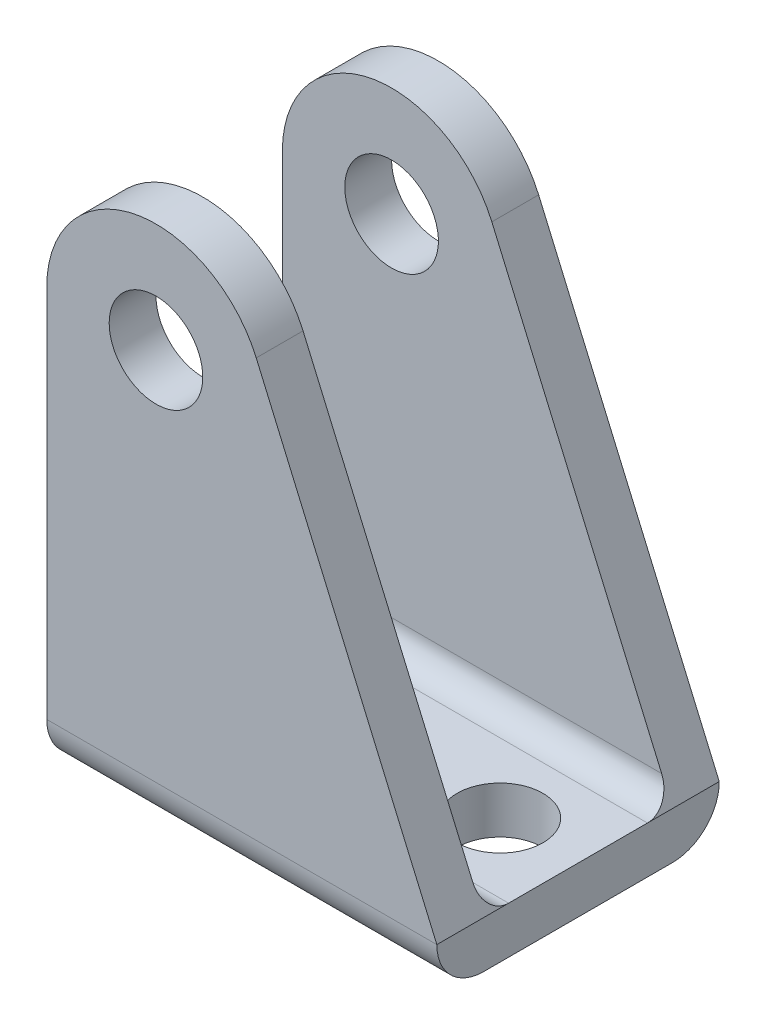
ISO-10303-21;
HEADER;
FILE_DESCRIPTION(('STEP AP214'),'2;1');
FILE_NAME('part.step','',(''),(''),'','','');
FILE_SCHEMA(('AUTOMOTIVE_DESIGN { 1 0 10303 214 1 1 1 1 }'));
ENDSEC;
DATA;
#1=APPLICATION_CONTEXT('core data for automotive mechanical design processes');
#2=APPLICATION_PROTOCOL_DEFINITION('international standard','automotive_design',2000,#1);
#3=PRODUCT_CONTEXT('',#1,'mechanical');
#4=PRODUCT('Part','Part','',(#3));
#5=PRODUCT_RELATED_PRODUCT_CATEGORY('part','',(#4));
#6=PRODUCT_DEFINITION_FORMATION('','',#4);
#7=PRODUCT_DEFINITION_CONTEXT('part definition',#1,'design');
#8=PRODUCT_DEFINITION('design','',#6,#7);
#9=PRODUCT_DEFINITION_SHAPE('','',#8);
#10=(LENGTH_UNIT() NAMED_UNIT(*) SI_UNIT(.MILLI.,.METRE.));
#11=(NAMED_UNIT(*) PLANE_ANGLE_UNIT() SI_UNIT($,.RADIAN.));
#12=(NAMED_UNIT(*) SI_UNIT($,.STERADIAN.) SOLID_ANGLE_UNIT());
#13=UNCERTAINTY_MEASURE_WITH_UNIT(LENGTH_MEASURE(1.E-05),#10,'distance_accuracy_value','');
#14=(GEOMETRIC_REPRESENTATION_CONTEXT(3) GLOBAL_UNCERTAINTY_ASSIGNED_CONTEXT((#13)) GLOBAL_UNIT_ASSIGNED_CONTEXT((#10,
#11,#12)) REPRESENTATION_CONTEXT('',''));
#15=CARTESIAN_POINT('',(0.,0.,0.));
#16=DIRECTION('',(0.,0.,1.));
#17=DIRECTION('',(1.,0.,0.));
#18=AXIS2_PLACEMENT_3D('',#15,#16,#17);
#19=CARTESIAN_POINT('',(25.,3.,-9.05));
#20=DIRECTION('',(0.,0.,1.));
#21=DIRECTION('',(1.,0.,0.));
#22=AXIS2_PLACEMENT_3D('',#19,#20,#21);
#23=PLANE('',#22);
#24=CARTESIAN_POINT('',(7.,27.,-9.05));
#25=DIRECTION('',(0.,0.,1.));
#26=DIRECTION('',(1.,0.,0.));
#27=AXIS2_PLACEMENT_3D('',#24,#25,#26);
#28=CIRCLE('',#27,3.);
#29=CARTESIAN_POINT('',(10.,27.,-9.05));
#30=VERTEX_POINT('',#29);
#31=EDGE_CURVE('E250',#30,#30,#28,.F.);
#32=ORIENTED_EDGE('',*,*,#31,.F.);
#33=EDGE_LOOP('',(#32));
#34=FACE_BOUND('',#33,.T.);
#35=DIRECTION('',(-1.,0.,0.));
#36=VECTOR('',#35,1.);
#37=CARTESIAN_POINT('',(25.,3.,-9.05));
#38=LINE('',#37,#36);
#39=CARTESIAN_POINT('',(25.,3.,-9.05));
#40=VERTEX_POINT('',#39);
#41=CARTESIAN_POINT('',(0.,3.,-9.05));
#42=VERTEX_POINT('',#41);
#43=EDGE_CURVE('E216',#40,#42,#38,.T.);
#44=ORIENTED_EDGE('',*,*,#43,.T.);
#45=DIRECTION('',(0.,1.,0.));
#46=VECTOR('',#45,1.);
#47=CARTESIAN_POINT('',(0.,3.,-9.05));
#48=LINE('',#47,#46);
#49=CARTESIAN_POINT('',(0.,27.,-9.05));
#50=VERTEX_POINT('',#49);
#51=EDGE_CURVE('E189',#42,#50,#48,.T.);
#52=ORIENTED_EDGE('',*,*,#51,.T.);
#53=CARTESIAN_POINT('',(6.99999999999999,27.,-9.05));
#54=DIRECTION('',(0.,0.,1.));
#55=DIRECTION('',(1.,0.,0.));
#56=AXIS2_PLACEMENT_3D('',#53,#54,#55);
#57=CIRCLE('',#56,6.99999999999999);
#58=CARTESIAN_POINT('',(13.4254221344375,29.7773999341615,-9.05));
#59=VERTEX_POINT('',#58);
#60=EDGE_CURVE('E169',#50,#59,#57,.F.);
#61=ORIENTED_EDGE('',*,*,#60,.T.);
#62=DIRECTION('',(0.396771419165927,-0.91791744777679,0.));
#63=VECTOR('',#62,1.);
#64=CARTESIAN_POINT('',(25.,3.,-9.05));
#65=LINE('',#64,#63);
#66=EDGE_CURVE('E161',#59,#40,#65,.T.);
#67=ORIENTED_EDGE('',*,*,#66,.T.);
#68=EDGE_LOOP('',(#44,#52,#61,#67));
#69=FACE_BOUND('',#68,.T.);
#70=ADVANCED_FACE('F33',(#34,#69),#23,.F.);
#71=CARTESIAN_POINT('',(25.,34.,-6.05));
#72=DIRECTION('',(0.,0.,-1.));
#73=DIRECTION('',(-1.,0.,0.));
#74=AXIS2_PLACEMENT_3D('',#71,#72,#73);
#75=PLANE('',#74);
#76=CARTESIAN_POINT('',(7.,27.,-6.05));
#77=DIRECTION('',(0.,0.,-1.));
#78=DIRECTION('',(-1.,0.,0.));
#79=AXIS2_PLACEMENT_3D('',#76,#77,#78);
#80=CIRCLE('',#79,3.);
#81=CARTESIAN_POINT('',(4.,27.,-6.05));
#82=VERTEX_POINT('',#81);
#83=EDGE_CURVE('E253',#82,#82,#80,.F.);
#84=ORIENTED_EDGE('',*,*,#83,.F.);
#85=EDGE_LOOP('',(#84));
#86=FACE_BOUND('',#85,.T.);
#87=CARTESIAN_POINT('',(6.99999999999999,27.,-6.05));
#88=DIRECTION('',(0.,0.,-1.));
#89=DIRECTION('',(-1.,0.,0.));
#90=AXIS2_PLACEMENT_3D('',#87,#88,#89);
#91=CIRCLE('',#90,6.99999999999999);
#92=CARTESIAN_POINT('',(13.4254221344375,29.7773999341615,-6.05));
#93=VERTEX_POINT('',#92);
#94=CARTESIAN_POINT('',(0.,27.,-6.05));
#95=VERTEX_POINT('',#94);
#96=EDGE_CURVE('E166',#93,#95,#91,.F.);
#97=ORIENTED_EDGE('',*,*,#96,.T.);
#98=DIRECTION('',(0.,-1.,0.));
#99=VECTOR('',#98,1.);
#100=CARTESIAN_POINT('',(0.,34.,-6.05));
#101=LINE('',#100,#99);
#102=CARTESIAN_POINT('',(0.,4.6,-6.05));
#103=VERTEX_POINT('',#102);
#104=EDGE_CURVE('E186',#95,#103,#101,.T.);
#105=ORIENTED_EDGE('',*,*,#104,.T.);
#106=DIRECTION('',(-1.,0.,0.));
#107=VECTOR('',#106,1.);
#108=CARTESIAN_POINT('',(25.,4.6,-6.05));
#109=LINE('',#108,#107);
#110=CARTESIAN_POINT('',(24.3083972069568,4.6,-6.05));
#111=VERTEX_POINT('',#110);
#112=EDGE_CURVE('E213',#111,#103,#109,.T.);
#113=ORIENTED_EDGE('',*,*,#112,.F.);
#114=DIRECTION('',(-0.396771419165927,0.91791744777679,0.));
#115=VECTOR('',#114,1.);
#116=CARTESIAN_POINT('',(13.7096943386216,29.1197456689247,-6.05));
#117=LINE('',#116,#115);
#118=EDGE_CURVE('E158',#111,#93,#117,.T.);
#119=ORIENTED_EDGE('',*,*,#118,.T.);
#120=EDGE_LOOP('',(#97,#105,#113,#119));
#121=FACE_BOUND('',#120,.T.);
#122=ADVANCED_FACE('F242',(#86,#121),#75,.F.);
#123=CARTESIAN_POINT('',(25.,4.6,6.05));
#124=DIRECTION('',(0.,0.,1.));
#125=DIRECTION('',(1.,0.,0.));
#126=AXIS2_PLACEMENT_3D('',#123,#124,#125);
#127=PLANE('',#126);
#128=CARTESIAN_POINT('',(7.,27.,6.05));
#129=DIRECTION('',(0.,0.,1.));
#130=DIRECTION('',(1.,0.,0.));
#131=AXIS2_PLACEMENT_3D('',#128,#129,#130);
#132=CIRCLE('',#131,3.);
#133=CARTESIAN_POINT('',(10.,27.,6.05));
#134=VERTEX_POINT('',#133);
#135=EDGE_CURVE('E306',#134,#134,#132,.F.);
#136=ORIENTED_EDGE('',*,*,#135,.F.);
#137=EDGE_LOOP('',(#136));
#138=FACE_BOUND('',#137,.T.);
#139=DIRECTION('',(-1.,0.,0.));
#140=VECTOR('',#139,1.);
#141=CARTESIAN_POINT('',(25.,4.6,6.05));
#142=LINE('',#141,#140);
#143=CARTESIAN_POINT('',(24.3083972069568,4.6,6.05));
#144=VERTEX_POINT('',#143);
#145=CARTESIAN_POINT('',(0.,4.6,6.05));
#146=VERTEX_POINT('',#145);
#147=EDGE_CURVE('E204',#144,#146,#142,.T.);
#148=ORIENTED_EDGE('',*,*,#147,.T.);
#149=DIRECTION('',(0.,1.,0.));
#150=VECTOR('',#149,1.);
#151=CARTESIAN_POINT('',(0.,4.6,6.05));
#152=LINE('',#151,#150);
#153=CARTESIAN_POINT('',(0.,27.,6.05));
#154=VERTEX_POINT('',#153);
#155=EDGE_CURVE('E174',#146,#154,#152,.T.);
#156=ORIENTED_EDGE('',*,*,#155,.T.);
#157=CARTESIAN_POINT('',(6.99999999999999,27.,6.05));
#158=DIRECTION('',(0.,0.,1.));
#159=DIRECTION('',(1.,0.,0.));
#160=AXIS2_PLACEMENT_3D('',#157,#158,#159);
#161=CIRCLE('',#160,6.99999999999999);
#162=CARTESIAN_POINT('',(13.4254221344375,29.7773999341615,6.05));
#163=VERTEX_POINT('',#162);
#164=EDGE_CURVE('E164',#154,#163,#161,.F.);
#165=ORIENTED_EDGE('',*,*,#164,.T.);
#166=DIRECTION('',(0.396771419165927,-0.91791744777679,0.));
#167=VECTOR('',#166,1.);
#168=CARTESIAN_POINT('',(24.4172745465095,4.34811590549289,6.05));
#169=LINE('',#168,#167);
#170=EDGE_CURVE('E140',#163,#144,#169,.T.);
#171=ORIENTED_EDGE('',*,*,#170,.T.);
#172=EDGE_LOOP('',(#148,#156,#165,#171));
#173=FACE_BOUND('',#172,.T.);
#174=ADVANCED_FACE('F267',(#138,#173),#127,.F.);
#175=CARTESIAN_POINT('',(25.,34.,9.05));
#176=DIRECTION('',(0.,0.,-1.));
#177=DIRECTION('',(-1.,0.,0.));
#178=AXIS2_PLACEMENT_3D('',#175,#176,#177);
#179=PLANE('',#178);
#180=CARTESIAN_POINT('',(7.,27.,9.05));
#181=DIRECTION('',(0.,0.,-1.));
#182=DIRECTION('',(-1.,0.,0.));
#183=AXIS2_PLACEMENT_3D('',#180,#181,#182);
#184=CIRCLE('',#183,3.);
#185=CARTESIAN_POINT('',(4.,27.,9.05));
#186=VERTEX_POINT('',#185);
#187=EDGE_CURVE('E37',#186,#186,#184,.F.);
#188=ORIENTED_EDGE('',*,*,#187,.F.);
#189=EDGE_LOOP('',(#188));
#190=FACE_BOUND('',#189,.T.);
#191=CARTESIAN_POINT('',(6.99999999999999,27.,9.05));
#192=DIRECTION('',(0.,0.,-1.));
#193=DIRECTION('',(-1.,0.,0.));
#194=AXIS2_PLACEMENT_3D('',#191,#192,#193);
#195=CIRCLE('',#194,6.99999999999999);
#196=CARTESIAN_POINT('',(13.4254221344375,29.7773999341615,9.05));
#197=VERTEX_POINT('',#196);
#198=CARTESIAN_POINT('',(0.,27.,9.05));
#199=VERTEX_POINT('',#198);
#200=EDGE_CURVE('E42',#197,#199,#195,.F.);
#201=ORIENTED_EDGE('',*,*,#200,.T.);
#202=DIRECTION('',(0.,-1.,0.));
#203=VECTOR('',#202,1.);
#204=CARTESIAN_POINT('',(0.,34.,9.05));
#205=LINE('',#204,#203);
#206=CARTESIAN_POINT('',(0.,3.,9.05));
#207=VERTEX_POINT('',#206);
#208=EDGE_CURVE('E11',#199,#207,#205,.T.);
#209=ORIENTED_EDGE('',*,*,#208,.T.);
#210=DIRECTION('',(-1.,0.,0.));
#211=VECTOR('',#210,1.);
#212=CARTESIAN_POINT('',(25.,3.,9.05));
#213=LINE('',#212,#211);
#214=CARTESIAN_POINT('',(25.,3.,9.05));
#215=VERTEX_POINT('',#214);
#216=EDGE_CURVE('E147',#215,#207,#213,.T.);
#217=ORIENTED_EDGE('',*,*,#216,.F.);
#218=DIRECTION('',(-0.396771419165927,0.91791744777679,0.));
#219=VECTOR('',#218,1.);
#220=CARTESIAN_POINT('',(13.7096943386216,29.1197456689247,9.05));
#221=LINE('',#220,#219);
#222=EDGE_CURVE('E137',#215,#197,#221,.T.);
#223=ORIENTED_EDGE('',*,*,#222,.T.);
#224=EDGE_LOOP('',(#201,#209,#217,#223));
#225=FACE_BOUND('',#224,.T.);
#226=ADVANCED_FACE('F145',(#190,#225),#179,.F.);
#227=CARTESIAN_POINT('',(25.,2.99999999999999,6.05000000000001));
#228=DIRECTION('',(-1.,0.,0.));
#229=DIRECTION('',(0.,0.,1.));
#230=AXIS2_PLACEMENT_3D('',#227,#228,#229);
#231=CYLINDRICAL_SURFACE('',#230,2.99999999999999);
#232=ORIENTED_EDGE('',*,*,#216,.T.);
#233=CARTESIAN_POINT('',(0.,2.99999999999999,6.05000000000001));
#234=DIRECTION('',(1.,0.,0.));
#235=DIRECTION('',(0.,1.,0.));
#236=AXIS2_PLACEMENT_3D('',#233,#234,#235);
#237=CIRCLE('',#236,2.99999999999999);
#238=CARTESIAN_POINT('',(0.,0.,6.05));
#239=VERTEX_POINT('',#238);
#240=EDGE_CURVE('E171',#207,#239,#237,.T.);
#241=ORIENTED_EDGE('',*,*,#240,.T.);
#242=DIRECTION('',(-1.,0.,0.));
#243=VECTOR('',#242,1.);
#244=CARTESIAN_POINT('',(25.,0.,6.05));
#245=LINE('',#244,#243);
#246=CARTESIAN_POINT('',(25.,0.,6.05));
#247=VERTEX_POINT('',#246);
#248=EDGE_CURVE('E222',#247,#239,#245,.T.);
#249=ORIENTED_EDGE('',*,*,#248,.F.);
#250=CARTESIAN_POINT('',(25.,2.99999999999999,6.05000000000001));
#251=DIRECTION('',(1.,0.,0.));
#252=DIRECTION('',(0.,0.,-1.));
#253=AXIS2_PLACEMENT_3D('',#250,#251,#252);
#254=CIRCLE('',#253,2.99999999999999);
#255=EDGE_CURVE('E195',#215,#247,#254,.T.);
#256=ORIENTED_EDGE('',*,*,#255,.F.);
#257=EDGE_LOOP('',(#232,#241,#249,#256));
#258=FACE_BOUND('',#257,.T.);
#259=ADVANCED_FACE('F35',(#258),#231,.T.);
#260=CARTESIAN_POINT('',(25.,0.,6.05));
#261=DIRECTION('',(0.,1.,0.));
#262=DIRECTION('',(0.,0.,1.));
#263=AXIS2_PLACEMENT_3D('',#260,#261,#262);
#264=PLANE('',#263);
#265=CARTESIAN_POINT('',(20.,0.,0.));
#266=DIRECTION('',(0.,1.,0.));
#267=DIRECTION('',(0.,0.,1.));
#268=AXIS2_PLACEMENT_3D('',#265,#266,#267);
#269=CIRCLE('',#268,2.75);
#270=CARTESIAN_POINT('',(20.,0.,2.75));
#271=VERTEX_POINT('',#270);
#272=EDGE_CURVE('E298',#271,#271,#269,.F.);
#273=ORIENTED_EDGE('',*,*,#272,.F.);
#274=EDGE_LOOP('',(#273));
#275=FACE_BOUND('',#274,.T.);
#276=CARTESIAN_POINT('',(5.,0.,0.));
#277=DIRECTION('',(0.,1.,0.));
#278=DIRECTION('',(0.,0.,1.));
#279=AXIS2_PLACEMENT_3D('',#276,#277,#278);
#280=CIRCLE('',#279,2.75);
#281=CARTESIAN_POINT('',(5.,0.,2.75));
#282=VERTEX_POINT('',#281);
#283=EDGE_CURVE('E301',#282,#282,#280,.F.);
#284=ORIENTED_EDGE('',*,*,#283,.F.);
#285=EDGE_LOOP('',(#284));
#286=FACE_BOUND('',#285,.T.);
#287=ORIENTED_EDGE('',*,*,#248,.T.);
#288=DIRECTION('',(0.,0.,-1.));
#289=VECTOR('',#288,1.);
#290=CARTESIAN_POINT('',(0.,0.,25.));
#291=LINE('',#290,#289);
#292=CARTESIAN_POINT('',(0.,0.,-6.04999999999999));
#293=VERTEX_POINT('',#292);
#294=EDGE_CURVE('E141',#239,#293,#291,.T.);
#295=ORIENTED_EDGE('',*,*,#294,.T.);
#296=DIRECTION('',(-1.,0.,0.));
#297=VECTOR('',#296,1.);
#298=CARTESIAN_POINT('',(25.,0.,-6.05));
#299=LINE('',#298,#297);
#300=CARTESIAN_POINT('',(25.,0.,-6.05));
#301=VERTEX_POINT('',#300);
#302=EDGE_CURVE('E219',#301,#293,#299,.T.);
#303=ORIENTED_EDGE('',*,*,#302,.F.);
#304=DIRECTION('',(0.,0.,-1.));
#305=VECTOR('',#304,1.);
#306=CARTESIAN_POINT('',(25.,0.,6.05));
#307=LINE('',#306,#305);
#308=EDGE_CURVE('E57',#247,#301,#307,.T.);
#309=ORIENTED_EDGE('',*,*,#308,.F.);
#310=EDGE_LOOP('',(#287,#295,#303,#309));
#311=FACE_BOUND('',#310,.T.);
#312=ADVANCED_FACE('F263',(#275,#286,#311),#264,.F.);
#313=CARTESIAN_POINT('',(25.,3.00000000000001,-6.04999999999999));
#314=DIRECTION('',(-1.,0.,0.));
#315=DIRECTION('',(0.,0.,1.));
#316=AXIS2_PLACEMENT_3D('',#313,#314,#315);
#317=CYLINDRICAL_SURFACE('',#316,3.00000000000001);
#318=ORIENTED_EDGE('',*,*,#302,.T.);
#319=CARTESIAN_POINT('',(0.,3.00000000000001,-6.04999999999999));
#320=DIRECTION('',(1.,0.,0.));
#321=DIRECTION('',(0.,1.,0.));
#322=AXIS2_PLACEMENT_3D('',#319,#320,#321);
#323=CIRCLE('',#322,3.00000000000001);
#324=EDGE_CURVE('E192',#293,#42,#323,.T.);
#325=ORIENTED_EDGE('',*,*,#324,.T.);
#326=ORIENTED_EDGE('',*,*,#43,.F.);
#327=CARTESIAN_POINT('',(25.,3.00000000000001,-6.04999999999999));
#328=DIRECTION('',(1.,0.,0.));
#329=DIRECTION('',(0.,0.,-1.));
#330=AXIS2_PLACEMENT_3D('',#327,#328,#329);
#331=CIRCLE('',#330,3.00000000000001);
#332=EDGE_CURVE('E198',#301,#40,#331,.T.);
#333=ORIENTED_EDGE('',*,*,#332,.F.);
#334=EDGE_LOOP('',(#318,#325,#326,#333));
#335=FACE_BOUND('',#334,.T.);
#336=ADVANCED_FACE('F261',(#335),#317,.T.);
#337=CARTESIAN_POINT('',(25.,4.59999999999999,-4.45000000000001));
#338=DIRECTION('',(-1.,0.,0.));
#339=DIRECTION('',(0.,0.,1.));
#340=AXIS2_PLACEMENT_3D('',#337,#338,#339);
#341=CYLINDRICAL_SURFACE('',#340,1.59999999999999);
#342=ORIENTED_EDGE('',*,*,#112,.T.);
#343=CARTESIAN_POINT('',(0.,4.59999999999999,-4.45000000000001));
#344=DIRECTION('',(1.,0.,0.));
#345=DIRECTION('',(0.,1.,0.));
#346=AXIS2_PLACEMENT_3D('',#343,#344,#345);
#347=CIRCLE('',#346,1.59999999999999);
#348=CARTESIAN_POINT('',(0.,3.,-4.45));
#349=VERTEX_POINT('',#348);
#350=EDGE_CURVE('E183',#103,#349,#347,.F.);
#351=ORIENTED_EDGE('',*,*,#350,.T.);
#352=DIRECTION('',(-1.,0.,0.));
#353=VECTOR('',#352,1.);
#354=CARTESIAN_POINT('',(25.,3.,-4.45));
#355=LINE('',#354,#353);
#356=CARTESIAN_POINT('',(25.,3.,-4.45));
#357=VERTEX_POINT('',#356);
#358=EDGE_CURVE('E210',#357,#349,#355,.T.);
#359=ORIENTED_EDGE('',*,*,#358,.F.);
#360=CARTESIAN_POINT('',(24.3083972069568,4.59999999999999,-4.45000000000001));
#361=DIRECTION('',(-0.91791744777679,-0.396771419165927,0.));
#362=DIRECTION('',(-0.396771419165927,0.91791744777679,0.));
#363=AXIS2_PLACEMENT_3D('',#360,#361,#362);
#364=ELLIPSE('',#363,1.74307613813771,1.59999999999999);
#365=EDGE_CURVE('E49',#357,#111,#364,.F.);
#366=ORIENTED_EDGE('',*,*,#365,.T.);
#367=EDGE_LOOP('',(#342,#351,#359,#366));
#368=FACE_BOUND('',#367,.T.);
#369=ADVANCED_FACE('F239',(#368),#341,.F.);
#370=CARTESIAN_POINT('',(25.,3.,-4.45));
#371=DIRECTION('',(0.,-1.,0.));
#372=DIRECTION('',(0.,0.,-1.));
#373=AXIS2_PLACEMENT_3D('',#370,#371,#372);
#374=PLANE('',#373);
#375=CARTESIAN_POINT('',(20.,3.,0.));
#376=DIRECTION('',(0.,1.,0.));
#377=DIRECTION('',(0.,0.,1.));
#378=AXIS2_PLACEMENT_3D('',#375,#376,#377);
#379=CIRCLE('',#378,2.75);
#380=CARTESIAN_POINT('',(20.,3.,2.75));
#381=VERTEX_POINT('',#380);
#382=EDGE_CURVE('E492',#381,#381,#379,.T.);
#383=ORIENTED_EDGE('',*,*,#382,.F.);
#384=EDGE_LOOP('',(#383));
#385=FACE_BOUND('',#384,.T.);
#386=CARTESIAN_POINT('',(5.,3.,0.));
#387=DIRECTION('',(0.,1.,0.));
#388=DIRECTION('',(0.,0.,1.));
#389=AXIS2_PLACEMENT_3D('',#386,#387,#388);
#390=CIRCLE('',#389,2.75);
#391=CARTESIAN_POINT('',(5.,3.,2.75));
#392=VERTEX_POINT('',#391);
#393=EDGE_CURVE('E303',#392,#392,#390,.T.);
#394=ORIENTED_EDGE('',*,*,#393,.F.);
#395=EDGE_LOOP('',(#394));
#396=FACE_BOUND('',#395,.T.);
#397=ORIENTED_EDGE('',*,*,#358,.T.);
#398=DIRECTION('',(0.,0.,1.));
#399=VECTOR('',#398,1.);
#400=CARTESIAN_POINT('',(0.,3.,-4.45));
#401=LINE('',#400,#399);
#402=CARTESIAN_POINT('',(0.,3.,4.45));
#403=VERTEX_POINT('',#402);
#404=EDGE_CURVE('E180',#349,#403,#401,.T.);
#405=ORIENTED_EDGE('',*,*,#404,.T.);
#406=DIRECTION('',(-1.,0.,0.));
#407=VECTOR('',#406,1.);
#408=CARTESIAN_POINT('',(25.,3.,4.45));
#409=LINE('',#408,#407);
#410=CARTESIAN_POINT('',(25.,3.,4.45));
#411=VERTEX_POINT('',#410);
#412=EDGE_CURVE('E207',#411,#403,#409,.T.);
#413=ORIENTED_EDGE('',*,*,#412,.F.);
#414=DIRECTION('',(0.,0.,1.));
#415=VECTOR('',#414,1.);
#416=CARTESIAN_POINT('',(25.,3.,-4.45));
#417=LINE('',#416,#415);
#418=EDGE_CURVE('E200',#357,#411,#417,.T.);
#419=ORIENTED_EDGE('',*,*,#418,.F.);
#420=EDGE_LOOP('',(#397,#405,#413,#419));
#421=FACE_BOUND('',#420,.T.);
#422=ADVANCED_FACE('F235',(#385,#396,#421),#374,.F.);
#423=CARTESIAN_POINT('',(25.,4.6,4.45));
#424=DIRECTION('',(-1.,0.,0.));
#425=DIRECTION('',(0.,0.,1.));
#426=AXIS2_PLACEMENT_3D('',#423,#424,#425);
#427=CYLINDRICAL_SURFACE('',#426,1.6);
#428=ORIENTED_EDGE('',*,*,#412,.T.);
#429=CARTESIAN_POINT('',(0.,4.6,4.45));
#430=DIRECTION('',(1.,0.,0.));
#431=DIRECTION('',(0.,1.,0.));
#432=AXIS2_PLACEMENT_3D('',#429,#430,#431);
#433=CIRCLE('',#432,1.6);
#434=EDGE_CURVE('E177',#403,#146,#433,.F.);
#435=ORIENTED_EDGE('',*,*,#434,.T.);
#436=ORIENTED_EDGE('',*,*,#147,.F.);
#437=CARTESIAN_POINT('',(24.3083972069568,4.6,4.45));
#438=DIRECTION('',(-0.91791744777679,-0.396771419165927,0.));
#439=DIRECTION('',(-0.396771419165927,0.91791744777679,0.));
#440=AXIS2_PLACEMENT_3D('',#437,#438,#439);
#441=ELLIPSE('',#440,1.74307613813772,1.6);
#442=EDGE_CURVE('E150',#144,#411,#441,.F.);
#443=ORIENTED_EDGE('',*,*,#442,.T.);
#444=EDGE_LOOP('',(#428,#435,#436,#443));
#445=FACE_BOUND('',#444,.T.);
#446=ADVANCED_FACE('F229',(#445),#427,.F.);
#447=CARTESIAN_POINT('',(25.,2.99999999999999,6.05000000000001));
#448=DIRECTION('',(1.,0.,0.));
#449=DIRECTION('',(0.,0.,-1.));
#450=AXIS2_PLACEMENT_3D('',#447,#448,#449);
#451=PLANE('',#450);
#452=DIRECTION('',(0.,0.,-1.));
#453=VECTOR('',#452,1.);
#454=CARTESIAN_POINT('',(25.,2.99999999999999,6.05000000000001));
#455=LINE('',#454,#453);
#456=EDGE_CURVE('E132',#215,#411,#455,.T.);
#457=ORIENTED_EDGE('',*,*,#456,.F.);
#458=ORIENTED_EDGE('',*,*,#255,.T.);
#459=ORIENTED_EDGE('',*,*,#308,.T.);
#460=ORIENTED_EDGE('',*,*,#332,.T.);
#461=EDGE_CURVE('E225',#357,#40,#455,.T.);
#462=ORIENTED_EDGE('',*,*,#461,.F.);
#463=ORIENTED_EDGE('',*,*,#418,.T.);
#464=EDGE_LOOP('',(#457,#458,#459,#460,#462,#463));
#465=FACE_BOUND('',#464,.T.);
#466=ADVANCED_FACE('F232',(#465),#451,.T.);
#467=CARTESIAN_POINT('',(0.,27.,25.));
#468=DIRECTION('',(1.,0.,0.));
#469=DIRECTION('',(0.,1.,0.));
#470=AXIS2_PLACEMENT_3D('',#467,#468,#469);
#471=PLANE('',#470);
#472=ORIENTED_EDGE('',*,*,#294,.F.);
#473=ORIENTED_EDGE('',*,*,#240,.F.);
#474=ORIENTED_EDGE('',*,*,#208,.F.);
#475=DIRECTION('',(0.,0.,-1.));
#476=VECTOR('',#475,1.);
#477=CARTESIAN_POINT('',(0.,27.,25.));
#478=LINE('',#477,#476);
#479=EDGE_CURVE('E129',#199,#154,#478,.T.);
#480=ORIENTED_EDGE('',*,*,#479,.T.);
#481=ORIENTED_EDGE('',*,*,#155,.F.);
#482=ORIENTED_EDGE('',*,*,#434,.F.);
#483=ORIENTED_EDGE('',*,*,#404,.F.);
#484=ORIENTED_EDGE('',*,*,#350,.F.);
#485=ORIENTED_EDGE('',*,*,#104,.F.);
#486=EDGE_CURVE('E245',#95,#50,#478,.T.);
#487=ORIENTED_EDGE('',*,*,#486,.T.);
#488=ORIENTED_EDGE('',*,*,#51,.F.);
#489=ORIENTED_EDGE('',*,*,#324,.F.);
#490=EDGE_LOOP('',(#472,#473,#474,#480,#481,#482,#483,#484,#485,#487,#488,#489));
#491=FACE_BOUND('',#490,.T.);
#492=ADVANCED_FACE('F237',(#491),#471,.F.);
#493=CARTESIAN_POINT('',(6.99999999999999,27.,25.));
#494=DIRECTION('',(0.,0.,-1.));
#495=DIRECTION('',(-1.,0.,0.));
#496=AXIS2_PLACEMENT_3D('',#493,#494,#495);
#497=CYLINDRICAL_SURFACE('',#496,6.99999999999999);
#498=ORIENTED_EDGE('',*,*,#486,.F.);
#499=ORIENTED_EDGE('',*,*,#96,.F.);
#500=DIRECTION('',(0.,0.,-1.));
#501=VECTOR('',#500,1.);
#502=CARTESIAN_POINT('',(13.4254221344375,29.7773999341615,25.));
#503=LINE('',#502,#501);
#504=EDGE_CURVE('E142',#93,#59,#503,.T.);
#505=ORIENTED_EDGE('',*,*,#504,.T.);
#506=ORIENTED_EDGE('',*,*,#60,.F.);
#507=EDGE_LOOP('',(#498,#499,#505,#506));
#508=FACE_BOUND('',#507,.T.);
#509=ADVANCED_FACE('F247',(#508),#497,.T.);
#510=ORIENTED_EDGE('',*,*,#479,.F.);
#511=ORIENTED_EDGE('',*,*,#200,.F.);
#512=EDGE_CURVE('E127',#197,#163,#503,.T.);
#513=ORIENTED_EDGE('',*,*,#512,.T.);
#514=ORIENTED_EDGE('',*,*,#164,.F.);
#515=EDGE_LOOP('',(#510,#511,#513,#514));
#516=FACE_BOUND('',#515,.T.);
#517=ADVANCED_FACE('F126',(#516),#497,.T.);
#518=CARTESIAN_POINT('',(25.,3.,25.));
#519=DIRECTION('',(-0.91791744777679,-0.396771419165927,0.));
#520=DIRECTION('',(0.396771419165927,-0.91791744777679,0.));
#521=AXIS2_PLACEMENT_3D('',#518,#519,#520);
#522=PLANE('',#521);
#523=ORIENTED_EDGE('',*,*,#504,.F.);
#524=ORIENTED_EDGE('',*,*,#118,.F.);
#525=ORIENTED_EDGE('',*,*,#365,.F.);
#526=ORIENTED_EDGE('',*,*,#461,.T.);
#527=ORIENTED_EDGE('',*,*,#66,.F.);
#528=EDGE_LOOP('',(#523,#524,#525,#526,#527));
#529=FACE_BOUND('',#528,.T.);
#530=ADVANCED_FACE('F256',(#529),#522,.F.);
#531=ORIENTED_EDGE('',*,*,#170,.F.);
#532=ORIENTED_EDGE('',*,*,#512,.F.);
#533=ORIENTED_EDGE('',*,*,#222,.F.);
#534=ORIENTED_EDGE('',*,*,#456,.T.);
#535=ORIENTED_EDGE('',*,*,#442,.F.);
#536=EDGE_LOOP('',(#531,#532,#533,#534,#535));
#537=FACE_BOUND('',#536,.T.);
#538=ADVANCED_FACE('F136',(#537),#522,.F.);
#539=CARTESIAN_POINT('',(7.,27.,12.1));
#540=DIRECTION('',(0.,0.,-1.));
#541=DIRECTION('',(-1.,0.,0.));
#542=AXIS2_PLACEMENT_3D('',#539,#540,#541);
#543=CYLINDRICAL_SURFACE('',#542,3.);
#544=ORIENTED_EDGE('',*,*,#187,.T.);
#545=EDGE_LOOP('',(#544));
#546=FACE_BOUND('',#545,.T.);
#547=ORIENTED_EDGE('',*,*,#135,.T.);
#548=EDGE_LOOP('',(#547));
#549=FACE_BOUND('',#548,.T.);
#550=ADVANCED_FACE('F319',(#546,#549),#543,.F.);
#551=ORIENTED_EDGE('',*,*,#83,.T.);
#552=EDGE_LOOP('',(#551));
#553=FACE_BOUND('',#552,.T.);
#554=ORIENTED_EDGE('',*,*,#31,.T.);
#555=EDGE_LOOP('',(#554));
#556=FACE_BOUND('',#555,.T.);
#557=ADVANCED_FACE('F315',(#553,#556),#543,.F.);
#558=CARTESIAN_POINT('',(5.,3.,0.));
#559=DIRECTION('',(0.,-1.,0.));
#560=DIRECTION('',(0.,0.,-1.));
#561=AXIS2_PLACEMENT_3D('',#558,#559,#560);
#562=CYLINDRICAL_SURFACE('',#561,2.75);
#563=ORIENTED_EDGE('',*,*,#393,.T.);
#564=EDGE_LOOP('',(#563));
#565=FACE_BOUND('',#564,.T.);
#566=ORIENTED_EDGE('',*,*,#283,.T.);
#567=EDGE_LOOP('',(#566));
#568=FACE_BOUND('',#567,.T.);
#569=ADVANCED_FACE('F318',(#565,#568),#562,.F.);
#570=CARTESIAN_POINT('',(20.,3.,0.));
#571=DIRECTION('',(0.,-1.,0.));
#572=DIRECTION('',(0.,0.,-1.));
#573=AXIS2_PLACEMENT_3D('',#570,#571,#572);
#574=CYLINDRICAL_SURFACE('',#573,2.75);
#575=ORIENTED_EDGE('',*,*,#382,.T.);
#576=EDGE_LOOP('',(#575));
#577=FACE_BOUND('',#576,.T.);
#578=ORIENTED_EDGE('',*,*,#272,.T.);
#579=EDGE_LOOP('',(#578));
#580=FACE_BOUND('',#579,.T.);
#581=ADVANCED_FACE('F325',(#577,#580),#574,.F.);
#582=CLOSED_SHELL('',(#70,#122,#174,#226,#259,#312,#336,#369,#422,#446,#466,#492,#509,#517,#530,
#538,#550,#557,#569,#581));
#583=MANIFOLD_SOLID_BREP('B2',#582);
#584=ADVANCED_BREP_SHAPE_REPRESENTATION('',(#18,#583),#14);
#585=SHAPE_DEFINITION_REPRESENTATION(#9,#584);
ENDSEC;
END-ISO-10303-21;
